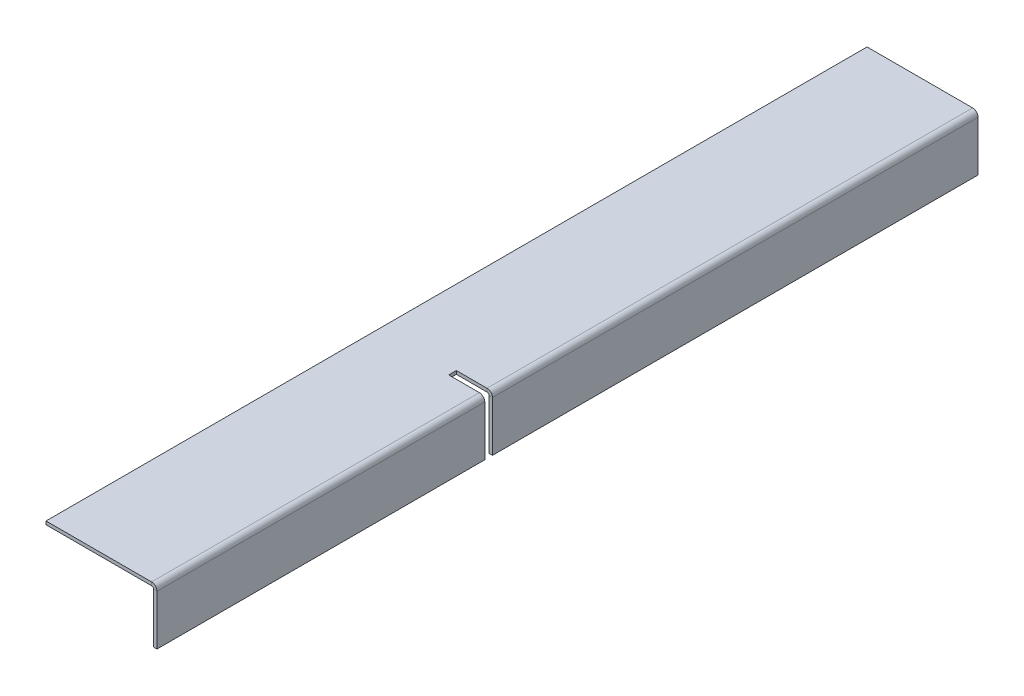
ISO-10303-21;
HEADER;
FILE_DESCRIPTION(('STEP AP214'),'2;1');
FILE_NAME('part.step','',(''),(''),'','','');
FILE_SCHEMA(('AUTOMOTIVE_DESIGN { 1 0 10303 214 1 1 1 1 }'));
ENDSEC;
DATA;
#1=APPLICATION_CONTEXT('core data for automotive mechanical design processes');
#2=APPLICATION_PROTOCOL_DEFINITION('international standard','automotive_design',2000,#1);
#3=PRODUCT_CONTEXT('',#1,'mechanical');
#4=PRODUCT('Part','Part','',(#3));
#5=PRODUCT_RELATED_PRODUCT_CATEGORY('part','',(#4));
#6=PRODUCT_DEFINITION_FORMATION('','',#4);
#7=PRODUCT_DEFINITION_CONTEXT('part definition',#1,'design');
#8=PRODUCT_DEFINITION('design','',#6,#7);
#9=PRODUCT_DEFINITION_SHAPE('','',#8);
#10=(LENGTH_UNIT() NAMED_UNIT(*) SI_UNIT(.MILLI.,.METRE.));
#11=(NAMED_UNIT(*) PLANE_ANGLE_UNIT() SI_UNIT($,.RADIAN.));
#12=(NAMED_UNIT(*) SI_UNIT($,.STERADIAN.) SOLID_ANGLE_UNIT());
#13=UNCERTAINTY_MEASURE_WITH_UNIT(LENGTH_MEASURE(1.E-05),#10,'distance_accuracy_value','');
#14=(GEOMETRIC_REPRESENTATION_CONTEXT(3) GLOBAL_UNCERTAINTY_ASSIGNED_CONTEXT((#13)) GLOBAL_UNIT_ASSIGNED_CONTEXT((#10,
#11,#12)) REPRESENTATION_CONTEXT('',''));
#15=CARTESIAN_POINT('',(0.,0.,0.));
#16=DIRECTION('',(0.,0.,1.));
#17=DIRECTION('',(1.,0.,0.));
#18=AXIS2_PLACEMENT_3D('',#15,#16,#17);
#19=CARTESIAN_POINT('',(-13.,20.2395491076025,175.066614050682));
#20=DIRECTION('',(0.,0.,-1.));
#21=DIRECTION('',(-1.,0.,0.));
#22=AXIS2_PLACEMENT_3D('',#19,#20,#21);
#23=PLANE('',#22);
#24=DIRECTION('',(0.,1.,0.));
#25=VECTOR('',#24,1.);
#26=CARTESIAN_POINT('',(0.,20.2395491076025,175.066614050682));
#27=LINE('',#26,#25);
#28=CARTESIAN_POINT('',(0.,0.,175.066614050682));
#29=VERTEX_POINT('',#28);
#30=CARTESIAN_POINT('',(0.,18.0634,175.066614050682));
#31=VERTEX_POINT('',#30);
#32=EDGE_CURVE('E305',#29,#31,#27,.T.);
#33=ORIENTED_EDGE('',*,*,#32,.T.);
#34=DIRECTION('',(-1.,0.,0.));
#35=VECTOR('',#34,1.);
#36=CARTESIAN_POINT('',(0.,18.0634,175.066614050682));
#37=LINE('',#36,#35);
#38=CARTESIAN_POINT('',(-1.19999999999998,18.0634,175.066614050682));
#39=VERTEX_POINT('',#38);
#40=EDGE_CURVE('E11',#31,#39,#37,.T.);
#41=ORIENTED_EDGE('',*,*,#40,.T.);
#42=DIRECTION('',(0.,-1.,0.));
#43=VECTOR('',#42,1.);
#44=CARTESIAN_POINT('',(-1.19999999999998,0.,175.066614050682));
#45=LINE('',#44,#43);
#46=CARTESIAN_POINT('',(-1.19999999999998,0.,175.066614050682));
#47=VERTEX_POINT('',#46);
#48=EDGE_CURVE('E312',#39,#47,#45,.T.);
#49=ORIENTED_EDGE('',*,*,#48,.T.);
#50=DIRECTION('',(1.,0.,0.));
#51=VECTOR('',#50,1.);
#52=CARTESIAN_POINT('',(0.,0.,175.066614050682));
#53=LINE('',#52,#51);
#54=EDGE_CURVE('E285',#47,#29,#53,.T.);
#55=ORIENTED_EDGE('',*,*,#54,.T.);
#56=EDGE_LOOP('',(#33,#41,#49,#55));
#57=FACE_BOUND('',#56,.T.);
#58=ADVANCED_FACE('F44',(#57),#23,.F.);
#59=DIRECTION('',(1.,0.,0.));
#60=VECTOR('',#59,1.);
#61=CARTESIAN_POINT('',(0.,18.8,175.066614050682));
#62=LINE('',#61,#60);
#63=CARTESIAN_POINT('',(-13.,18.8,175.066614050682));
#64=VERTEX_POINT('',#63);
#65=CARTESIAN_POINT('',(-1.93659999999996,18.8,175.066614050682));
#66=VERTEX_POINT('',#65);
#67=EDGE_CURVE('E274',#64,#66,#62,.T.);
#68=ORIENTED_EDGE('',*,*,#67,.T.);
#69=DIRECTION('',(0.,1.,0.));
#70=VECTOR('',#69,1.);
#71=CARTESIAN_POINT('',(-1.93659999999996,18.8,175.066614050682));
#72=LINE('',#71,#70);
#73=CARTESIAN_POINT('',(-1.93659999999996,20.,175.066614050682));
#74=VERTEX_POINT('',#73);
#75=EDGE_CURVE('E53',#66,#74,#72,.T.);
#76=ORIENTED_EDGE('',*,*,#75,.T.);
#77=DIRECTION('',(1.,0.,0.));
#78=VECTOR('',#77,1.);
#79=CARTESIAN_POINT('',(0.,20.,175.066614050682));
#80=LINE('',#79,#78);
#81=CARTESIAN_POINT('',(-13.,20.,175.066614050682));
#82=VERTEX_POINT('',#81);
#83=EDGE_CURVE('E270',#82,#74,#80,.T.);
#84=ORIENTED_EDGE('',*,*,#83,.F.);
#85=DIRECTION('',(0.,1.,0.));
#86=VECTOR('',#85,1.);
#87=CARTESIAN_POINT('',(-13.,20.2395491076025,175.066614050682));
#88=LINE('',#87,#86);
#89=EDGE_CURVE('E286',#64,#82,#88,.T.);
#90=ORIENTED_EDGE('',*,*,#89,.F.);
#91=EDGE_LOOP('',(#68,#76,#84,#90));
#92=FACE_BOUND('',#91,.T.);
#93=ADVANCED_FACE('F267',(#92),#23,.F.);
#94=CARTESIAN_POINT('',(-13.,20.2395491076025,177.816614050682));
#95=DIRECTION('',(0.,0.,1.));
#96=DIRECTION('',(1.,0.,0.));
#97=AXIS2_PLACEMENT_3D('',#94,#95,#96);
#98=PLANE('',#97);
#99=DIRECTION('',(0.,1.,0.));
#100=VECTOR('',#99,1.);
#101=CARTESIAN_POINT('',(-1.19999999999998,0.,177.816614050682));
#102=LINE('',#101,#100);
#103=CARTESIAN_POINT('',(-1.19999999999998,0.,177.816614050682));
#104=VERTEX_POINT('',#103);
#105=CARTESIAN_POINT('',(-1.19999999999998,18.0634,177.816614050682));
#106=VERTEX_POINT('',#105);
#107=EDGE_CURVE('E331',#104,#106,#102,.T.);
#108=ORIENTED_EDGE('',*,*,#107,.T.);
#109=DIRECTION('',(1.,0.,0.));
#110=VECTOR('',#109,1.);
#111=CARTESIAN_POINT('',(-1.19999999999998,18.0634,177.816614050682));
#112=LINE('',#111,#110);
#113=CARTESIAN_POINT('',(0.,18.0634,177.816614050682));
#114=VERTEX_POINT('',#113);
#115=EDGE_CURVE('E254',#106,#114,#112,.T.);
#116=ORIENTED_EDGE('',*,*,#115,.T.);
#117=DIRECTION('',(0.,-1.,0.));
#118=VECTOR('',#117,1.);
#119=CARTESIAN_POINT('',(0.,20.2395491076025,177.816614050682));
#120=LINE('',#119,#118);
#121=CARTESIAN_POINT('',(0.,0.,177.816614050682));
#122=VERTEX_POINT('',#121);
#123=EDGE_CURVE('E308',#114,#122,#120,.T.);
#124=ORIENTED_EDGE('',*,*,#123,.T.);
#125=DIRECTION('',(-1.,0.,0.));
#126=VECTOR('',#125,1.);
#127=CARTESIAN_POINT('',(0.,0.,177.816614050682));
#128=LINE('',#127,#126);
#129=EDGE_CURVE('E135',#122,#104,#128,.T.);
#130=ORIENTED_EDGE('',*,*,#129,.T.);
#131=EDGE_LOOP('',(#108,#116,#124,#130));
#132=FACE_BOUND('',#131,.T.);
#133=ADVANCED_FACE('F394',(#132),#98,.F.);
#134=DIRECTION('',(-1.,0.,0.));
#135=VECTOR('',#134,1.);
#136=CARTESIAN_POINT('',(0.,20.,177.816614050682));
#137=LINE('',#136,#135);
#138=CARTESIAN_POINT('',(-1.93659999999996,20.,177.816614050682));
#139=VERTEX_POINT('',#138);
#140=CARTESIAN_POINT('',(-13.,20.,177.816614050682));
#141=VERTEX_POINT('',#140);
#142=EDGE_CURVE('E322',#139,#141,#137,.T.);
#143=ORIENTED_EDGE('',*,*,#142,.F.);
#144=DIRECTION('',(0.,-1.,0.));
#145=VECTOR('',#144,1.);
#146=CARTESIAN_POINT('',(-1.93659999999996,20.,177.816614050682));
#147=LINE('',#146,#145);
#148=CARTESIAN_POINT('',(-1.93659999999996,18.8,177.816614050682));
#149=VERTEX_POINT('',#148);
#150=EDGE_CURVE('E250',#139,#149,#147,.T.);
#151=ORIENTED_EDGE('',*,*,#150,.T.);
#152=DIRECTION('',(-1.,0.,0.));
#153=VECTOR('',#152,1.);
#154=CARTESIAN_POINT('',(0.,18.8,177.816614050682));
#155=LINE('',#154,#153);
#156=CARTESIAN_POINT('',(-13.,18.8,177.816614050682));
#157=VERTEX_POINT('',#156);
#158=EDGE_CURVE('E339',#149,#157,#155,.T.);
#159=ORIENTED_EDGE('',*,*,#158,.T.);
#160=DIRECTION('',(0.,-1.,0.));
#161=VECTOR('',#160,1.);
#162=CARTESIAN_POINT('',(-13.,20.2395491076025,177.816614050682));
#163=LINE('',#162,#161);
#164=EDGE_CURVE('E307',#141,#157,#163,.T.);
#165=ORIENTED_EDGE('',*,*,#164,.F.);
#166=EDGE_LOOP('',(#143,#151,#159,#165));
#167=FACE_BOUND('',#166,.T.);
#168=ADVANCED_FACE('F414',(#167),#98,.F.);
#169=CARTESIAN_POINT('',(-1.93659999999996,18.0634,296.));
#170=DIRECTION('',(0.,0.,-1.));
#171=DIRECTION('',(-1.,0.,0.));
#172=AXIS2_PLACEMENT_3D('',#169,#170,#171);
#173=CYLINDRICAL_SURFACE('',#172,0.7366);
#174=CARTESIAN_POINT('',(-1.93659999999996,18.0634,177.816614050682));
#175=DIRECTION('',(0.,0.,1.));
#176=DIRECTION('',(1.,0.,0.));
#177=AXIS2_PLACEMENT_3D('',#174,#175,#176);
#178=CIRCLE('',#177,0.7366);
#179=EDGE_CURVE('E335',#106,#149,#178,.T.);
#180=ORIENTED_EDGE('',*,*,#179,.F.);
#181=DIRECTION('',(0.,0.,-1.));
#182=VECTOR('',#181,1.);
#183=CARTESIAN_POINT('',(-1.19999999999998,18.0634,296.));
#184=LINE('',#183,#182);
#185=CARTESIAN_POINT('',(-1.19999999999998,18.0634,296.));
#186=VERTEX_POINT('',#185);
#187=EDGE_CURVE('E211',#186,#106,#184,.T.);
#188=ORIENTED_EDGE('',*,*,#187,.F.);
#189=CARTESIAN_POINT('',(-1.93659999999996,18.0634,296.));
#190=DIRECTION('',(0.,0.,1.));
#191=DIRECTION('',(1.,0.,0.));
#192=AXIS2_PLACEMENT_3D('',#189,#190,#191);
#193=CIRCLE('',#192,0.7366);
#194=CARTESIAN_POINT('',(-1.93659999999996,18.8,296.));
#195=VERTEX_POINT('',#194);
#196=EDGE_CURVE('E162',#186,#195,#193,.T.);
#197=ORIENTED_EDGE('',*,*,#196,.T.);
#198=DIRECTION('',(0.,0.,-1.));
#199=VECTOR('',#198,1.);
#200=CARTESIAN_POINT('',(-1.93659999999996,18.8,296.));
#201=LINE('',#200,#199);
#202=EDGE_CURVE('E216',#195,#149,#201,.T.);
#203=ORIENTED_EDGE('',*,*,#202,.T.);
#204=EDGE_LOOP('',(#180,#188,#197,#203));
#205=FACE_BOUND('',#204,.T.);
#206=ADVANCED_FACE('F361',(#205),#173,.F.);
#207=CARTESIAN_POINT('',(-1.19999999999998,0.,296.));
#208=DIRECTION('',(-1.,0.,0.));
#209=DIRECTION('',(0.,0.,1.));
#210=AXIS2_PLACEMENT_3D('',#207,#208,#209);
#211=PLANE('',#210);
#212=ORIENTED_EDGE('',*,*,#107,.F.);
#213=DIRECTION('',(0.,0.,-1.));
#214=VECTOR('',#213,1.);
#215=CARTESIAN_POINT('',(-1.19999999999998,0.,296.));
#216=LINE('',#215,#214);
#217=CARTESIAN_POINT('',(-1.19999999999998,0.,296.));
#218=VERTEX_POINT('',#217);
#219=EDGE_CURVE('E207',#218,#104,#216,.T.);
#220=ORIENTED_EDGE('',*,*,#219,.F.);
#221=DIRECTION('',(0.,1.,0.));
#222=VECTOR('',#221,1.);
#223=CARTESIAN_POINT('',(-1.19999999999998,0.,296.));
#224=LINE('',#223,#222);
#225=EDGE_CURVE('E156',#218,#186,#224,.T.);
#226=ORIENTED_EDGE('',*,*,#225,.T.);
#227=ORIENTED_EDGE('',*,*,#187,.T.);
#228=EDGE_LOOP('',(#212,#220,#226,#227));
#229=FACE_BOUND('',#228,.T.);
#230=ADVANCED_FACE('F366',(#229),#211,.T.);
#231=CARTESIAN_POINT('',(0.,0.,296.));
#232=DIRECTION('',(0.,-1.,0.));
#233=DIRECTION('',(0.,0.,-1.));
#234=AXIS2_PLACEMENT_3D('',#231,#232,#233);
#235=PLANE('',#234);
#236=ORIENTED_EDGE('',*,*,#129,.F.);
#237=DIRECTION('',(0.,0.,-1.));
#238=VECTOR('',#237,1.);
#239=CARTESIAN_POINT('',(0.,0.,296.));
#240=LINE('',#239,#238);
#241=CARTESIAN_POINT('',(0.,0.,296.));
#242=VERTEX_POINT('',#241);
#243=EDGE_CURVE('E127',#242,#122,#240,.T.);
#244=ORIENTED_EDGE('',*,*,#243,.F.);
#245=DIRECTION('',(-1.,0.,0.));
#246=VECTOR('',#245,1.);
#247=CARTESIAN_POINT('',(0.,0.,296.));
#248=LINE('',#247,#246);
#249=EDGE_CURVE('E132',#242,#218,#248,.T.);
#250=ORIENTED_EDGE('',*,*,#249,.T.);
#251=ORIENTED_EDGE('',*,*,#219,.T.);
#252=EDGE_LOOP('',(#236,#244,#250,#251));
#253=FACE_BOUND('',#252,.T.);
#254=ADVANCED_FACE('F129',(#253),#235,.T.);
#255=CARTESIAN_POINT('',(0.,0.,296.));
#256=DIRECTION('',(-1.,0.,0.));
#257=DIRECTION('',(0.,0.,1.));
#258=AXIS2_PLACEMENT_3D('',#255,#256,#257);
#259=PLANE('',#258);
#260=ORIENTED_EDGE('',*,*,#243,.T.);
#261=ORIENTED_EDGE('',*,*,#123,.F.);
#262=DIRECTION('',(0.,0.,-1.));
#263=VECTOR('',#262,1.);
#264=CARTESIAN_POINT('',(0.,18.0634,296.));
#265=LINE('',#264,#263);
#266=CARTESIAN_POINT('',(0.,18.0634,296.));
#267=VERTEX_POINT('',#266);
#268=EDGE_CURVE('E147',#267,#114,#265,.T.);
#269=ORIENTED_EDGE('',*,*,#268,.F.);
#270=DIRECTION('',(0.,1.,0.));
#271=VECTOR('',#270,1.);
#272=CARTESIAN_POINT('',(0.,0.,296.));
#273=LINE('',#272,#271);
#274=EDGE_CURVE('E144',#242,#267,#273,.T.);
#275=ORIENTED_EDGE('',*,*,#274,.F.);
#276=EDGE_LOOP('',(#260,#261,#269,#275));
#277=FACE_BOUND('',#276,.T.);
#278=ADVANCED_FACE('F145',(#277),#259,.F.);
#279=CARTESIAN_POINT('',(-1.93659999999996,18.0634,296.));
#280=DIRECTION('',(0.,0.,-1.));
#281=DIRECTION('',(-1.,0.,0.));
#282=AXIS2_PLACEMENT_3D('',#279,#280,#281);
#283=CYLINDRICAL_SURFACE('',#282,1.9366);
#284=ORIENTED_EDGE('',*,*,#268,.T.);
#285=CARTESIAN_POINT('',(-1.93659999999996,18.0634,177.816614050682));
#286=DIRECTION('',(0.,0.,1.));
#287=DIRECTION('',(1.,0.,0.));
#288=AXIS2_PLACEMENT_3D('',#285,#286,#287);
#289=CIRCLE('',#288,1.9366);
#290=EDGE_CURVE('E242',#114,#139,#289,.T.);
#291=ORIENTED_EDGE('',*,*,#290,.T.);
#292=DIRECTION('',(0.,0.,-1.));
#293=VECTOR('',#292,1.);
#294=CARTESIAN_POINT('',(-1.93659999999996,20.,296.));
#295=LINE('',#294,#293);
#296=CARTESIAN_POINT('',(-1.93659999999996,20.,296.));
#297=VERTEX_POINT('',#296);
#298=EDGE_CURVE('E200',#297,#139,#295,.T.);
#299=ORIENTED_EDGE('',*,*,#298,.F.);
#300=CARTESIAN_POINT('',(-1.93659999999996,18.0634,296.));
#301=DIRECTION('',(0.,0.,-1.));
#302=DIRECTION('',(-1.,0.,0.));
#303=AXIS2_PLACEMENT_3D('',#300,#301,#302);
#304=CIRCLE('',#303,1.9366);
#305=EDGE_CURVE('E151',#267,#297,#304,.F.);
#306=ORIENTED_EDGE('',*,*,#305,.F.);
#307=EDGE_LOOP('',(#284,#291,#299,#306));
#308=FACE_BOUND('',#307,.T.);
#309=ADVANCED_FACE('F402',(#308),#283,.T.);
#310=CARTESIAN_POINT('',(0.,18.0634,296.));
#311=DIRECTION('',(0.,0.,1.));
#312=DIRECTION('',(1.,0.,0.));
#313=AXIS2_PLACEMENT_3D('',#310,#311,#312);
#314=PLANE('',#313);
#315=DIRECTION('',(-1.,0.,0.));
#316=VECTOR('',#315,1.);
#317=CARTESIAN_POINT('',(0.,18.0634,296.));
#318=LINE('',#317,#316);
#319=EDGE_CURVE('E235',#267,#186,#318,.T.);
#320=ORIENTED_EDGE('',*,*,#319,.F.);
#321=ORIENTED_EDGE('',*,*,#305,.T.);
#322=DIRECTION('',(0.,1.,0.));
#323=VECTOR('',#322,1.);
#324=CARTESIAN_POINT('',(-1.93659999999996,18.8,296.));
#325=LINE('',#324,#323);
#326=EDGE_CURVE('E67',#195,#297,#325,.T.);
#327=ORIENTED_EDGE('',*,*,#326,.F.);
#328=ORIENTED_EDGE('',*,*,#196,.F.);
#329=EDGE_LOOP('',(#320,#321,#327,#328));
#330=FACE_BOUND('',#329,.T.);
#331=ADVANCED_FACE('F46',(#330),#314,.T.);
#332=CARTESIAN_POINT('',(-1.93659999999996,18.8,296.));
#333=DIRECTION('',(0.,0.,1.));
#334=DIRECTION('',(1.,0.,0.));
#335=AXIS2_PLACEMENT_3D('',#332,#333,#334);
#336=PLANE('',#335);
#337=ORIENTED_EDGE('',*,*,#274,.T.);
#338=ORIENTED_EDGE('',*,*,#319,.T.);
#339=ORIENTED_EDGE('',*,*,#225,.F.);
#340=ORIENTED_EDGE('',*,*,#249,.F.);
#341=EDGE_LOOP('',(#337,#338,#339,#340));
#342=FACE_BOUND('',#341,.T.);
#343=ADVANCED_FACE('F154',(#342),#336,.T.);
#344=CARTESIAN_POINT('',(-1.93659999999996,20.,0.));
#345=DIRECTION('',(0.,0.,-1.));
#346=DIRECTION('',(-1.,0.,0.));
#347=AXIS2_PLACEMENT_3D('',#344,#345,#346);
#348=PLANE('',#347);
#349=DIRECTION('',(0.,-1.,0.));
#350=VECTOR('',#349,1.);
#351=CARTESIAN_POINT('',(-1.93659999999996,20.,0.));
#352=LINE('',#351,#350);
#353=CARTESIAN_POINT('',(-1.93659999999996,20.,0.));
#354=VERTEX_POINT('',#353);
#355=CARTESIAN_POINT('',(-1.93659999999996,18.8,0.));
#356=VERTEX_POINT('',#355);
#357=EDGE_CURVE('E230',#354,#356,#352,.T.);
#358=ORIENTED_EDGE('',*,*,#357,.F.);
#359=CARTESIAN_POINT('',(-1.93659999999996,18.0634,0.));
#360=DIRECTION('',(0.,0.,-1.));
#361=DIRECTION('',(-1.,0.,0.));
#362=AXIS2_PLACEMENT_3D('',#359,#360,#361);
#363=CIRCLE('',#362,1.9366);
#364=CARTESIAN_POINT('',(0.,18.0634,0.));
#365=VERTEX_POINT('',#364);
#366=EDGE_CURVE('E196',#365,#354,#363,.F.);
#367=ORIENTED_EDGE('',*,*,#366,.F.);
#368=DIRECTION('',(1.,0.,0.));
#369=VECTOR('',#368,1.);
#370=CARTESIAN_POINT('',(-1.19999999999998,18.0634,0.));
#371=LINE('',#370,#369);
#372=CARTESIAN_POINT('',(-1.19999999999998,18.0634,0.));
#373=VERTEX_POINT('',#372);
#374=EDGE_CURVE('E226',#373,#365,#371,.T.);
#375=ORIENTED_EDGE('',*,*,#374,.F.);
#376=CARTESIAN_POINT('',(-1.93659999999996,18.0634,0.));
#377=DIRECTION('',(0.,0.,1.));
#378=DIRECTION('',(1.,0.,0.));
#379=AXIS2_PLACEMENT_3D('',#376,#377,#378);
#380=CIRCLE('',#379,0.7366);
#381=EDGE_CURVE('E180',#373,#356,#380,.T.);
#382=ORIENTED_EDGE('',*,*,#381,.T.);
#383=EDGE_LOOP('',(#358,#367,#375,#382));
#384=FACE_BOUND('',#383,.T.);
#385=ADVANCED_FACE('F431',(#384),#348,.T.);
#386=CARTESIAN_POINT('',(-1.19999999999998,18.0634,0.));
#387=DIRECTION('',(0.,0.,-1.));
#388=DIRECTION('',(-1.,0.,0.));
#389=AXIS2_PLACEMENT_3D('',#386,#387,#388);
#390=PLANE('',#389);
#391=DIRECTION('',(-1.,0.,0.));
#392=VECTOR('',#391,1.);
#393=CARTESIAN_POINT('',(0.,20.,0.));
#394=LINE('',#393,#392);
#395=CARTESIAN_POINT('',(-40.,20.,0.));
#396=VERTEX_POINT('',#395);
#397=EDGE_CURVE('E168',#354,#396,#394,.T.);
#398=ORIENTED_EDGE('',*,*,#397,.F.);
#399=ORIENTED_EDGE('',*,*,#357,.T.);
#400=DIRECTION('',(1.,0.,0.));
#401=VECTOR('',#400,1.);
#402=CARTESIAN_POINT('',(0.,18.8,0.));
#403=LINE('',#402,#401);
#404=CARTESIAN_POINT('',(-40.,18.8,0.));
#405=VERTEX_POINT('',#404);
#406=EDGE_CURVE('E176',#356,#405,#403,.F.);
#407=ORIENTED_EDGE('',*,*,#406,.T.);
#408=DIRECTION('',(0.,1.,0.));
#409=VECTOR('',#408,1.);
#410=CARTESIAN_POINT('',(-40.,18.8,0.));
#411=LINE('',#410,#409);
#412=EDGE_CURVE('E171',#405,#396,#411,.T.);
#413=ORIENTED_EDGE('',*,*,#412,.T.);
#414=EDGE_LOOP('',(#398,#399,#407,#413));
#415=FACE_BOUND('',#414,.T.);
#416=ADVANCED_FACE('F429',(#415),#390,.T.);
#417=CARTESIAN_POINT('',(0.,20.,296.));
#418=DIRECTION('',(0.,-1.,0.));
#419=DIRECTION('',(0.,0.,-1.));
#420=AXIS2_PLACEMENT_3D('',#417,#418,#419);
#421=PLANE('',#420);
#422=ORIENTED_EDGE('',*,*,#298,.T.);
#423=ORIENTED_EDGE('',*,*,#142,.T.);
#424=DIRECTION('',(0.,0.,1.));
#425=VECTOR('',#424,1.);
#426=CARTESIAN_POINT('',(-13.,20.,296.));
#427=LINE('',#426,#425);
#428=EDGE_CURVE('E172',#82,#141,#427,.T.);
#429=ORIENTED_EDGE('',*,*,#428,.F.);
#430=ORIENTED_EDGE('',*,*,#83,.T.);
#431=EDGE_CURVE('E102',#74,#354,#295,.T.);
#432=ORIENTED_EDGE('',*,*,#431,.T.);
#433=ORIENTED_EDGE('',*,*,#397,.T.);
#434=DIRECTION('',(0.,0.,-1.));
#435=VECTOR('',#434,1.);
#436=CARTESIAN_POINT('',(-40.,20.,296.));
#437=LINE('',#436,#435);
#438=CARTESIAN_POINT('',(-40.,20.,296.));
#439=VERTEX_POINT('',#438);
#440=EDGE_CURVE('E223',#439,#396,#437,.T.);
#441=ORIENTED_EDGE('',*,*,#440,.F.);
#442=DIRECTION('',(-1.,0.,0.));
#443=VECTOR('',#442,1.);
#444=CARTESIAN_POINT('',(0.,20.,296.));
#445=LINE('',#444,#443);
#446=EDGE_CURVE('E108',#297,#439,#445,.T.);
#447=ORIENTED_EDGE('',*,*,#446,.F.);
#448=EDGE_LOOP('',(#422,#423,#429,#430,#432,#433,#441,#447));
#449=FACE_BOUND('',#448,.T.);
#450=ADVANCED_FACE('F282',(#449),#421,.F.);
#451=CARTESIAN_POINT('',(-40.,18.8,296.));
#452=DIRECTION('',(-1.,0.,0.));
#453=DIRECTION('',(0.,0.,1.));
#454=AXIS2_PLACEMENT_3D('',#451,#452,#453);
#455=PLANE('',#454);
#456=ORIENTED_EDGE('',*,*,#412,.F.);
#457=DIRECTION('',(0.,0.,-1.));
#458=VECTOR('',#457,1.);
#459=CARTESIAN_POINT('',(-40.,18.8,296.));
#460=LINE('',#459,#458);
#461=CARTESIAN_POINT('',(-40.,18.8,296.));
#462=VERTEX_POINT('',#461);
#463=EDGE_CURVE('E220',#462,#405,#460,.T.);
#464=ORIENTED_EDGE('',*,*,#463,.F.);
#465=DIRECTION('',(0.,1.,0.));
#466=VECTOR('',#465,1.);
#467=CARTESIAN_POINT('',(-40.,18.8,296.));
#468=LINE('',#467,#466);
#469=EDGE_CURVE('E347',#462,#439,#468,.T.);
#470=ORIENTED_EDGE('',*,*,#469,.T.);
#471=ORIENTED_EDGE('',*,*,#440,.T.);
#472=EDGE_LOOP('',(#456,#464,#470,#471));
#473=FACE_BOUND('',#472,.T.);
#474=ADVANCED_FACE('F405',(#473),#455,.T.);
#475=CARTESIAN_POINT('',(0.,18.8,296.));
#476=DIRECTION('',(0.,-1.,0.));
#477=DIRECTION('',(0.,0.,-1.));
#478=AXIS2_PLACEMENT_3D('',#475,#476,#477);
#479=PLANE('',#478);
#480=ORIENTED_EDGE('',*,*,#158,.F.);
#481=ORIENTED_EDGE('',*,*,#202,.F.);
#482=DIRECTION('',(1.,0.,0.));
#483=VECTOR('',#482,1.);
#484=CARTESIAN_POINT('',(0.,18.8,296.));
#485=LINE('',#484,#483);
#486=EDGE_CURVE('E351',#195,#462,#485,.F.);
#487=ORIENTED_EDGE('',*,*,#486,.T.);
#488=ORIENTED_EDGE('',*,*,#463,.T.);
#489=ORIENTED_EDGE('',*,*,#406,.F.);
#490=EDGE_CURVE('E215',#66,#356,#201,.T.);
#491=ORIENTED_EDGE('',*,*,#490,.F.);
#492=ORIENTED_EDGE('',*,*,#67,.F.);
#493=DIRECTION('',(0.,0.,1.));
#494=VECTOR('',#493,1.);
#495=CARTESIAN_POINT('',(-13.,18.8,296.));
#496=LINE('',#495,#494);
#497=EDGE_CURVE('E246',#64,#157,#496,.T.);
#498=ORIENTED_EDGE('',*,*,#497,.T.);
#499=EDGE_LOOP('',(#480,#481,#487,#488,#489,#491,#492,#498));
#500=FACE_BOUND('',#499,.T.);
#501=ADVANCED_FACE('F409',(#500),#479,.T.);
#502=CARTESIAN_POINT('',(-1.93659999999996,18.0634,175.066614050682));
#503=DIRECTION('',(0.,0.,-1.));
#504=DIRECTION('',(-1.,0.,0.));
#505=AXIS2_PLACEMENT_3D('',#502,#503,#504);
#506=CIRCLE('',#505,0.7366);
#507=EDGE_CURVE('E316',#66,#39,#506,.T.);
#508=ORIENTED_EDGE('',*,*,#507,.F.);
#509=ORIENTED_EDGE('',*,*,#490,.T.);
#510=ORIENTED_EDGE('',*,*,#381,.F.);
#511=EDGE_CURVE('E210',#39,#373,#184,.T.);
#512=ORIENTED_EDGE('',*,*,#511,.F.);
#513=EDGE_LOOP('',(#508,#509,#510,#512));
#514=FACE_BOUND('',#513,.T.);
#515=ADVANCED_FACE('F426',(#514),#173,.F.);
#516=ORIENTED_EDGE('',*,*,#48,.F.);
#517=ORIENTED_EDGE('',*,*,#511,.T.);
#518=DIRECTION('',(0.,1.,0.));
#519=VECTOR('',#518,1.);
#520=CARTESIAN_POINT('',(-1.19999999999998,0.,0.));
#521=LINE('',#520,#519);
#522=CARTESIAN_POINT('',(-1.19999999999998,0.,0.));
#523=VERTEX_POINT('',#522);
#524=EDGE_CURVE('E184',#523,#373,#521,.T.);
#525=ORIENTED_EDGE('',*,*,#524,.F.);
#526=EDGE_CURVE('E139',#47,#523,#216,.T.);
#527=ORIENTED_EDGE('',*,*,#526,.F.);
#528=EDGE_LOOP('',(#516,#517,#525,#527));
#529=FACE_BOUND('',#528,.T.);
#530=ADVANCED_FACE('F448',(#529),#211,.T.);
#531=ORIENTED_EDGE('',*,*,#54,.F.);
#532=ORIENTED_EDGE('',*,*,#526,.T.);
#533=DIRECTION('',(-1.,0.,0.));
#534=VECTOR('',#533,1.);
#535=CARTESIAN_POINT('',(0.,0.,0.));
#536=LINE('',#535,#534);
#537=CARTESIAN_POINT('',(0.,0.,0.));
#538=VERTEX_POINT('',#537);
#539=EDGE_CURVE('E188',#538,#523,#536,.T.);
#540=ORIENTED_EDGE('',*,*,#539,.F.);
#541=EDGE_CURVE('E140',#29,#538,#240,.T.);
#542=ORIENTED_EDGE('',*,*,#541,.F.);
#543=EDGE_LOOP('',(#531,#532,#540,#542));
#544=FACE_BOUND('',#543,.T.);
#545=ADVANCED_FACE('F444',(#544),#235,.T.);
#546=EDGE_CURVE('E204',#31,#365,#265,.T.);
#547=ORIENTED_EDGE('',*,*,#546,.F.);
#548=ORIENTED_EDGE('',*,*,#32,.F.);
#549=ORIENTED_EDGE('',*,*,#541,.T.);
#550=DIRECTION('',(0.,1.,0.));
#551=VECTOR('',#550,1.);
#552=CARTESIAN_POINT('',(0.,0.,0.));
#553=LINE('',#552,#551);
#554=EDGE_CURVE('E192',#538,#365,#553,.T.);
#555=ORIENTED_EDGE('',*,*,#554,.T.);
#556=EDGE_LOOP('',(#547,#548,#549,#555));
#557=FACE_BOUND('',#556,.T.);
#558=ADVANCED_FACE('F439',(#557),#259,.F.);
#559=ORIENTED_EDGE('',*,*,#431,.F.);
#560=CARTESIAN_POINT('',(-1.93659999999996,18.0634,175.066614050682));
#561=DIRECTION('',(0.,0.,-1.));
#562=DIRECTION('',(-1.,0.,0.));
#563=AXIS2_PLACEMENT_3D('',#560,#561,#562);
#564=CIRCLE('',#563,1.9366);
#565=EDGE_CURVE('E238',#74,#31,#564,.T.);
#566=ORIENTED_EDGE('',*,*,#565,.T.);
#567=ORIENTED_EDGE('',*,*,#546,.T.);
#568=ORIENTED_EDGE('',*,*,#366,.T.);
#569=EDGE_LOOP('',(#559,#566,#567,#568));
#570=FACE_BOUND('',#569,.T.);
#571=ADVANCED_FACE('F288',(#570),#283,.T.);
#572=CARTESIAN_POINT('',(-1.93659999999996,18.0634,296.));
#573=DIRECTION('',(0.,0.,1.));
#574=DIRECTION('',(1.,0.,0.));
#575=AXIS2_PLACEMENT_3D('',#572,#573,#574);
#576=PLANE('',#575);
#577=ORIENTED_EDGE('',*,*,#446,.T.);
#578=ORIENTED_EDGE('',*,*,#469,.F.);
#579=ORIENTED_EDGE('',*,*,#486,.F.);
#580=ORIENTED_EDGE('',*,*,#326,.T.);
#581=EDGE_LOOP('',(#577,#578,#579,#580));
#582=FACE_BOUND('',#581,.T.);
#583=ADVANCED_FACE('F406',(#582),#576,.T.);
#584=CARTESIAN_POINT('',(-1.93659999999996,18.0634,0.));
#585=DIRECTION('',(0.,0.,1.));
#586=DIRECTION('',(1.,0.,0.));
#587=AXIS2_PLACEMENT_3D('',#584,#585,#586);
#588=PLANE('',#587);
#589=ORIENTED_EDGE('',*,*,#524,.T.);
#590=ORIENTED_EDGE('',*,*,#374,.T.);
#591=ORIENTED_EDGE('',*,*,#554,.F.);
#592=ORIENTED_EDGE('',*,*,#539,.T.);
#593=EDGE_LOOP('',(#589,#590,#591,#592));
#594=FACE_BOUND('',#593,.T.);
#595=ADVANCED_FACE('F435',(#594),#588,.F.);
#596=CARTESIAN_POINT('',(-13.,0.,0.));
#597=DIRECTION('',(1.,0.,0.));
#598=DIRECTION('',(0.,0.,-1.));
#599=AXIS2_PLACEMENT_3D('',#596,#597,#598);
#600=PLANE('',#599);
#601=ORIENTED_EDGE('',*,*,#428,.T.);
#602=ORIENTED_EDGE('',*,*,#164,.T.);
#603=ORIENTED_EDGE('',*,*,#497,.F.);
#604=ORIENTED_EDGE('',*,*,#89,.T.);
#605=EDGE_LOOP('',(#601,#602,#603,#604));
#606=FACE_BOUND('',#605,.T.);
#607=ADVANCED_FACE('F416',(#606),#600,.T.);
#608=ORIENTED_EDGE('',*,*,#115,.F.);
#609=ORIENTED_EDGE('',*,*,#179,.T.);
#610=ORIENTED_EDGE('',*,*,#150,.F.);
#611=ORIENTED_EDGE('',*,*,#290,.F.);
#612=EDGE_LOOP('',(#608,#609,#610,#611));
#613=FACE_BOUND('',#612,.T.);
#614=ADVANCED_FACE('F396',(#613),#98,.F.);
#615=ORIENTED_EDGE('',*,*,#40,.F.);
#616=ORIENTED_EDGE('',*,*,#565,.F.);
#617=ORIENTED_EDGE('',*,*,#75,.F.);
#618=ORIENTED_EDGE('',*,*,#507,.T.);
#619=EDGE_LOOP('',(#615,#616,#617,#618));
#620=FACE_BOUND('',#619,.T.);
#621=ADVANCED_FACE('F278',(#620),#23,.F.);
#622=CLOSED_SHELL('',(#58,#93,#133,#168,#206,#230,#254,#278,#309,#331,#343,#385,#416,#450,#474,
#501,#515,#530,#545,#558,#571,#583,#595,#607,#614,#621));
#623=MANIFOLD_SOLID_BREP('B2',#622);
#624=ADVANCED_BREP_SHAPE_REPRESENTATION('',(#18,#623),#14);
#625=SHAPE_DEFINITION_REPRESENTATION(#9,#624);
ENDSEC;
END-ISO-10303-21;
